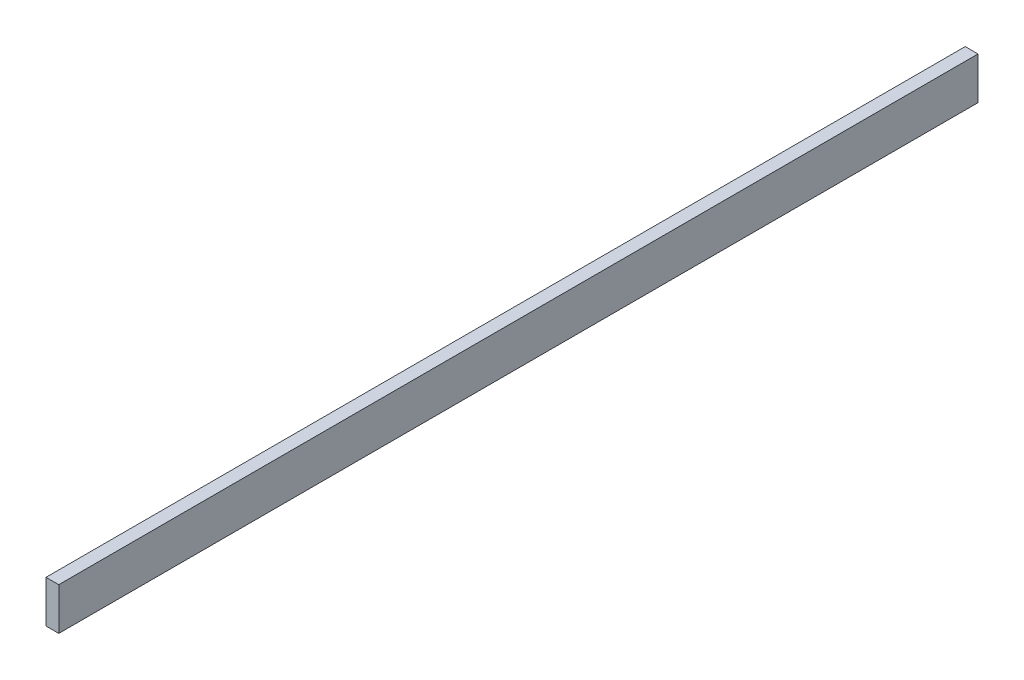
ISO-10303-21;
HEADER;
FILE_DESCRIPTION(('STEP AP214'),'2;1');
FILE_NAME('part.step','',(''),(''),'','','');
FILE_SCHEMA(('AUTOMOTIVE_DESIGN { 1 0 10303 214 1 1 1 1 }'));
ENDSEC;
DATA;
#1=APPLICATION_CONTEXT('core data for automotive mechanical design processes');
#2=APPLICATION_PROTOCOL_DEFINITION('international standard','automotive_design',2000,#1);
#3=PRODUCT_CONTEXT('',#1,'mechanical');
#4=PRODUCT('Part','Part','',(#3));
#5=PRODUCT_RELATED_PRODUCT_CATEGORY('part','',(#4));
#6=PRODUCT_DEFINITION_FORMATION('','',#4);
#7=PRODUCT_DEFINITION_CONTEXT('part definition',#1,'design');
#8=PRODUCT_DEFINITION('design','',#6,#7);
#9=PRODUCT_DEFINITION_SHAPE('','',#8);
#10=(LENGTH_UNIT() NAMED_UNIT(*) SI_UNIT(.MILLI.,.METRE.));
#11=(NAMED_UNIT(*) PLANE_ANGLE_UNIT() SI_UNIT($,.RADIAN.));
#12=(NAMED_UNIT(*) SI_UNIT($,.STERADIAN.) SOLID_ANGLE_UNIT());
#13=UNCERTAINTY_MEASURE_WITH_UNIT(LENGTH_MEASURE(1.E-05),#10,'distance_accuracy_value','');
#14=(GEOMETRIC_REPRESENTATION_CONTEXT(3) GLOBAL_UNCERTAINTY_ASSIGNED_CONTEXT((#13)) GLOBAL_UNIT_ASSIGNED_CONTEXT((#10,
#11,#12)) REPRESENTATION_CONTEXT('',''));
#15=CARTESIAN_POINT('',(0.,0.,0.));
#16=DIRECTION('',(0.,0.,1.));
#17=DIRECTION('',(1.,0.,0.));
#18=AXIS2_PLACEMENT_3D('',#15,#16,#17);
#19=CARTESIAN_POINT('',(3.17499999999999,-10.5,457.2));
#20=DIRECTION('',(-1.,0.,0.));
#21=DIRECTION('',(0.,0.,1.));
#22=AXIS2_PLACEMENT_3D('',#19,#20,#21);
#23=PLANE('',#22);
#24=DIRECTION('',(0.,1.,0.));
#25=VECTOR('',#24,1.);
#26=CARTESIAN_POINT('',(3.17499999999999,-10.5,0.));
#27=LINE('',#26,#25);
#28=CARTESIAN_POINT('',(3.17499999999999,-10.5,0.));
#29=VERTEX_POINT('',#28);
#30=CARTESIAN_POINT('',(3.17499999999999,10.5,0.));
#31=VERTEX_POINT('',#30);
#32=EDGE_CURVE('E96',#29,#31,#27,.T.);
#33=ORIENTED_EDGE('',*,*,#32,.T.);
#34=DIRECTION('',(0.,0.,-1.));
#35=VECTOR('',#34,1.);
#36=CARTESIAN_POINT('',(3.17499999999999,10.5,457.2));
#37=LINE('',#36,#35);
#38=CARTESIAN_POINT('',(3.17499999999999,10.5,457.2));
#39=VERTEX_POINT('',#38);
#40=EDGE_CURVE('E11',#39,#31,#37,.T.);
#41=ORIENTED_EDGE('',*,*,#40,.F.);
#42=DIRECTION('',(0.,1.,0.));
#43=VECTOR('',#42,1.);
#44=CARTESIAN_POINT('',(3.17499999999999,-10.5,457.2));
#45=LINE('',#44,#43);
#46=CARTESIAN_POINT('',(3.17499999999999,-10.5,457.2));
#47=VERTEX_POINT('',#46);
#48=EDGE_CURVE('E84',#47,#39,#45,.T.);
#49=ORIENTED_EDGE('',*,*,#48,.F.);
#50=DIRECTION('',(0.,0.,-1.));
#51=VECTOR('',#50,1.);
#52=CARTESIAN_POINT('',(3.17499999999999,-10.5,457.2));
#53=LINE('',#52,#51);
#54=EDGE_CURVE('E92',#47,#29,#53,.T.);
#55=ORIENTED_EDGE('',*,*,#54,.T.);
#56=EDGE_LOOP('',(#33,#41,#49,#55));
#57=FACE_BOUND('',#56,.T.);
#58=ADVANCED_FACE('F33',(#57),#23,.F.);
#59=CARTESIAN_POINT('',(-3.17500000000001,10.5,457.2));
#60=DIRECTION('',(0.,-1.,0.));
#61=DIRECTION('',(0.,0.,-1.));
#62=AXIS2_PLACEMENT_3D('',#59,#60,#61);
#63=PLANE('',#62);
#64=DIRECTION('',(-1.,0.,0.));
#65=VECTOR('',#64,1.);
#66=CARTESIAN_POINT('',(-3.17500000000001,10.5,0.));
#67=LINE('',#66,#65);
#68=CARTESIAN_POINT('',(-3.17500000000001,10.5,0.));
#69=VERTEX_POINT('',#68);
#70=EDGE_CURVE('E88',#31,#69,#67,.T.);
#71=ORIENTED_EDGE('',*,*,#70,.T.);
#72=DIRECTION('',(0.,0.,-1.));
#73=VECTOR('',#72,1.);
#74=CARTESIAN_POINT('',(-3.17500000000001,10.5,457.2));
#75=LINE('',#74,#73);
#76=CARTESIAN_POINT('',(-3.17500000000001,10.5,457.2));
#77=VERTEX_POINT('',#76);
#78=EDGE_CURVE('E41',#77,#69,#75,.T.);
#79=ORIENTED_EDGE('',*,*,#78,.F.);
#80=DIRECTION('',(-1.,0.,0.));
#81=VECTOR('',#80,1.);
#82=CARTESIAN_POINT('',(-3.17500000000001,10.5,457.2));
#83=LINE('',#82,#81);
#84=EDGE_CURVE('E79',#39,#77,#83,.T.);
#85=ORIENTED_EDGE('',*,*,#84,.F.);
#86=ORIENTED_EDGE('',*,*,#40,.T.);
#87=EDGE_LOOP('',(#71,#79,#85,#86));
#88=FACE_BOUND('',#87,.T.);
#89=ADVANCED_FACE('F87',(#88),#63,.F.);
#90=CARTESIAN_POINT('',(-3.17500000000001,-10.5,457.2));
#91=DIRECTION('',(1.,0.,0.));
#92=DIRECTION('',(0.,0.,-1.));
#93=AXIS2_PLACEMENT_3D('',#90,#91,#92);
#94=PLANE('',#93);
#95=DIRECTION('',(0.,-1.,0.));
#96=VECTOR('',#95,1.);
#97=CARTESIAN_POINT('',(-3.17500000000001,-10.5,0.));
#98=LINE('',#97,#96);
#99=CARTESIAN_POINT('',(-3.17500000000001,-10.5,0.));
#100=VERTEX_POINT('',#99);
#101=EDGE_CURVE('E66',#69,#100,#98,.T.);
#102=ORIENTED_EDGE('',*,*,#101,.T.);
#103=DIRECTION('',(0.,0.,-1.));
#104=VECTOR('',#103,1.);
#105=CARTESIAN_POINT('',(-3.17500000000001,-10.5,457.2));
#106=LINE('',#105,#104);
#107=CARTESIAN_POINT('',(-3.17500000000001,-10.5,457.2));
#108=VERTEX_POINT('',#107);
#109=EDGE_CURVE('E89',#108,#100,#106,.T.);
#110=ORIENTED_EDGE('',*,*,#109,.F.);
#111=DIRECTION('',(0.,-1.,0.));
#112=VECTOR('',#111,1.);
#113=CARTESIAN_POINT('',(-3.17500000000001,-10.5,457.2));
#114=LINE('',#113,#112);
#115=EDGE_CURVE('E82',#77,#108,#114,.T.);
#116=ORIENTED_EDGE('',*,*,#115,.F.);
#117=ORIENTED_EDGE('',*,*,#78,.T.);
#118=EDGE_LOOP('',(#102,#110,#116,#117));
#119=FACE_BOUND('',#118,.T.);
#120=ADVANCED_FACE('F90',(#119),#94,.F.);
#121=CARTESIAN_POINT('',(-3.17500000000001,-10.5,457.2));
#122=DIRECTION('',(0.,1.,0.));
#123=DIRECTION('',(0.,0.,1.));
#124=AXIS2_PLACEMENT_3D('',#121,#122,#123);
#125=PLANE('',#124);
#126=DIRECTION('',(1.,0.,0.));
#127=VECTOR('',#126,1.);
#128=CARTESIAN_POINT('',(-3.17500000000001,-10.5,0.));
#129=LINE('',#128,#127);
#130=EDGE_CURVE('E72',#100,#29,#129,.T.);
#131=ORIENTED_EDGE('',*,*,#130,.T.);
#132=ORIENTED_EDGE('',*,*,#54,.F.);
#133=DIRECTION('',(1.,0.,0.));
#134=VECTOR('',#133,1.);
#135=CARTESIAN_POINT('',(-3.17500000000001,-10.5,457.2));
#136=LINE('',#135,#134);
#137=EDGE_CURVE('E49',#108,#47,#136,.T.);
#138=ORIENTED_EDGE('',*,*,#137,.F.);
#139=ORIENTED_EDGE('',*,*,#109,.T.);
#140=EDGE_LOOP('',(#131,#132,#138,#139));
#141=FACE_BOUND('',#140,.T.);
#142=ADVANCED_FACE('F103',(#141),#125,.F.);
#143=CARTESIAN_POINT('',(0.,0.,457.2));
#144=DIRECTION('',(0.,0.,-1.));
#145=DIRECTION('',(-1.,0.,0.));
#146=AXIS2_PLACEMENT_3D('',#143,#144,#145);
#147=PLANE('',#146);
#148=ORIENTED_EDGE('',*,*,#48,.T.);
#149=ORIENTED_EDGE('',*,*,#84,.T.);
#150=ORIENTED_EDGE('',*,*,#115,.T.);
#151=ORIENTED_EDGE('',*,*,#137,.T.);
#152=EDGE_LOOP('',(#148,#149,#150,#151));
#153=FACE_BOUND('',#152,.T.);
#154=ADVANCED_FACE('F80',(#153),#147,.F.);
#155=CARTESIAN_POINT('',(0.,0.,0.));
#156=DIRECTION('',(0.,0.,-1.));
#157=DIRECTION('',(-1.,0.,0.));
#158=AXIS2_PLACEMENT_3D('',#155,#156,#157);
#159=PLANE('',#158);
#160=ORIENTED_EDGE('',*,*,#32,.F.);
#161=ORIENTED_EDGE('',*,*,#130,.F.);
#162=ORIENTED_EDGE('',*,*,#101,.F.);
#163=ORIENTED_EDGE('',*,*,#70,.F.);
#164=EDGE_LOOP('',(#160,#161,#162,#163));
#165=FACE_BOUND('',#164,.T.);
#166=ADVANCED_FACE('F106',(#165),#159,.T.);
#167=CLOSED_SHELL('',(#58,#89,#120,#142,#154,#166));
#168=MANIFOLD_SOLID_BREP('B2',#167);
#169=ADVANCED_BREP_SHAPE_REPRESENTATION('',(#18,#168),#14);
#170=SHAPE_DEFINITION_REPRESENTATION(#9,#169);
ENDSEC;
END-ISO-10303-21;
